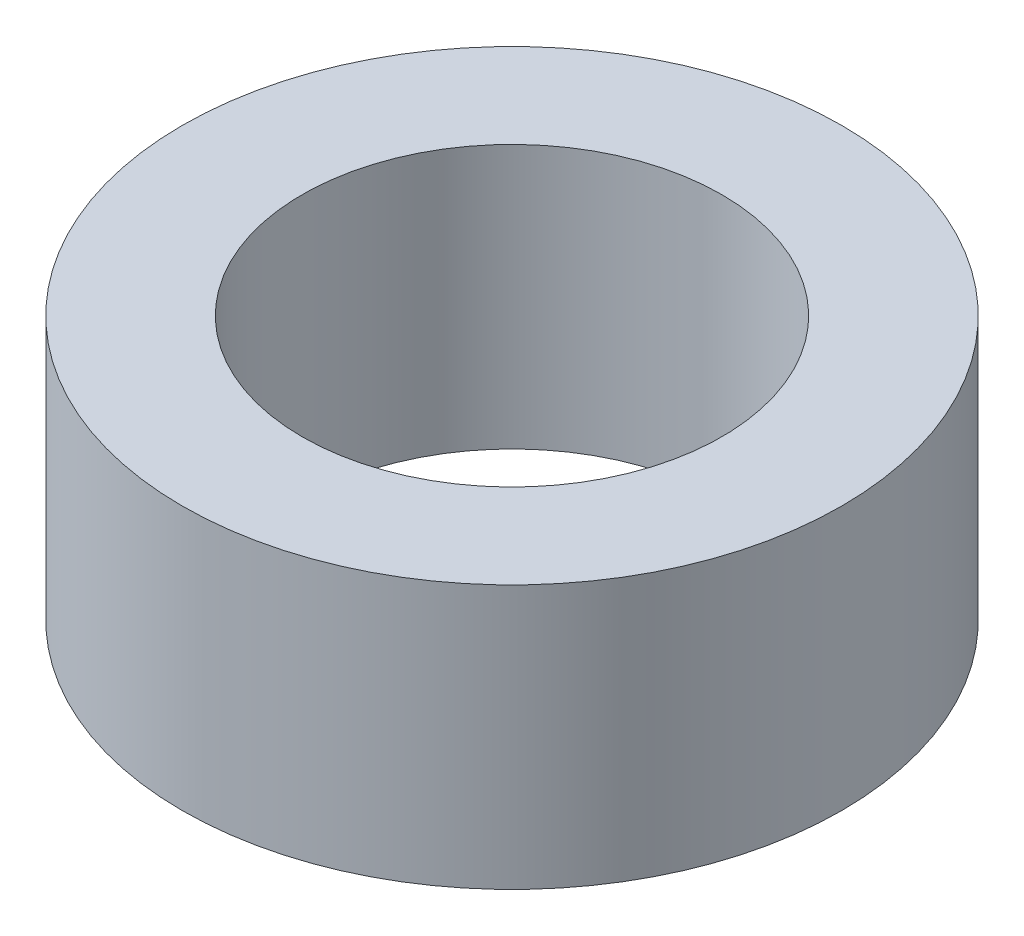
ISO-10303-21;
HEADER;
FILE_DESCRIPTION(('STEP AP214'),'2;1');
FILE_NAME('part.step','',(''),(''),'','','');
FILE_SCHEMA(('AUTOMOTIVE_DESIGN { 1 0 10303 214 1 1 1 1 }'));
ENDSEC;
DATA;
#1=APPLICATION_CONTEXT('core data for automotive mechanical design processes');
#2=APPLICATION_PROTOCOL_DEFINITION('international standard','automotive_design',2000,#1);
#3=PRODUCT_CONTEXT('',#1,'mechanical');
#4=PRODUCT('Part','Part','',(#3));
#5=PRODUCT_RELATED_PRODUCT_CATEGORY('part','',(#4));
#6=PRODUCT_DEFINITION_FORMATION('','',#4);
#7=PRODUCT_DEFINITION_CONTEXT('part definition',#1,'design');
#8=PRODUCT_DEFINITION('design','',#6,#7);
#9=PRODUCT_DEFINITION_SHAPE('','',#8);
#10=(LENGTH_UNIT() NAMED_UNIT(*) SI_UNIT(.MILLI.,.METRE.));
#11=(NAMED_UNIT(*) PLANE_ANGLE_UNIT() SI_UNIT($,.RADIAN.));
#12=(NAMED_UNIT(*) SI_UNIT($,.STERADIAN.) SOLID_ANGLE_UNIT());
#13=UNCERTAINTY_MEASURE_WITH_UNIT(LENGTH_MEASURE(1.E-05),#10,'distance_accuracy_value','');
#14=(GEOMETRIC_REPRESENTATION_CONTEXT(3) GLOBAL_UNCERTAINTY_ASSIGNED_CONTEXT((#13)) GLOBAL_UNIT_ASSIGNED_CONTEXT((#10,
#11,#12)) REPRESENTATION_CONTEXT('',''));
#15=CARTESIAN_POINT('',(0.,0.,0.));
#16=DIRECTION('',(0.,0.,1.));
#17=DIRECTION('',(1.,0.,0.));
#18=AXIS2_PLACEMENT_3D('',#15,#16,#17);
#19=CARTESIAN_POINT('',(0.,22.,0.));
#20=DIRECTION('',(0.,-1.,0.));
#21=DIRECTION('',(0.,0.,-1.));
#22=AXIS2_PLACEMENT_3D('',#19,#20,#21);
#23=CYLINDRICAL_SURFACE('',#22,27.5);
#24=CARTESIAN_POINT('',(0.,22.,0.));
#25=DIRECTION('',(0.,1.,0.));
#26=DIRECTION('',(0.,0.,1.));
#27=AXIS2_PLACEMENT_3D('',#24,#25,#26);
#28=CIRCLE('',#27,27.5);
#29=CARTESIAN_POINT('',(0.,22.,27.5));
#30=VERTEX_POINT('',#29);
#31=EDGE_CURVE('E10',#30,#30,#28,.T.);
#32=ORIENTED_EDGE('',*,*,#31,.F.);
#33=EDGE_LOOP('',(#32));
#34=FACE_BOUND('',#33,.T.);
#35=CARTESIAN_POINT('',(0.,0.,0.));
#36=DIRECTION('',(0.,1.,0.));
#37=DIRECTION('',(0.,0.,1.));
#38=AXIS2_PLACEMENT_3D('',#35,#36,#37);
#39=CIRCLE('',#38,27.5);
#40=CARTESIAN_POINT('',(0.,0.,27.5));
#41=VERTEX_POINT('',#40);
#42=EDGE_CURVE('E37',#41,#41,#39,.T.);
#43=ORIENTED_EDGE('',*,*,#42,.T.);
#44=EDGE_LOOP('',(#43));
#45=FACE_BOUND('',#44,.T.);
#46=ADVANCED_FACE('F40',(#34,#45),#23,.T.);
#47=CARTESIAN_POINT('',(0.,22.,0.));
#48=DIRECTION('',(0.,1.,0.));
#49=DIRECTION('',(0.,0.,1.));
#50=AXIS2_PLACEMENT_3D('',#47,#48,#49);
#51=PLANE('',#50);
#52=CARTESIAN_POINT('',(0.,22.,0.));
#53=DIRECTION('',(0.,1.,0.));
#54=DIRECTION('',(0.,0.,1.));
#55=AXIS2_PLACEMENT_3D('',#52,#53,#54);
#56=CIRCLE('',#55,17.5);
#57=CARTESIAN_POINT('',(0.,22.,17.5));
#58=VERTEX_POINT('',#57);
#59=EDGE_CURVE('E50',#58,#58,#56,.T.);
#60=ORIENTED_EDGE('',*,*,#59,.F.);
#61=EDGE_LOOP('',(#60));
#62=FACE_BOUND('',#61,.T.);
#63=ORIENTED_EDGE('',*,*,#31,.T.);
#64=EDGE_LOOP('',(#63));
#65=FACE_BOUND('',#64,.T.);
#66=ADVANCED_FACE('F59',(#62,#65),#51,.T.);
#67=CARTESIAN_POINT('',(0.,0.,0.));
#68=DIRECTION('',(0.,1.,0.));
#69=DIRECTION('',(0.,0.,1.));
#70=AXIS2_PLACEMENT_3D('',#67,#68,#69);
#71=PLANE('',#70);
#72=CARTESIAN_POINT('',(0.,0.,0.));
#73=DIRECTION('',(0.,1.,0.));
#74=DIRECTION('',(0.,0.,1.));
#75=AXIS2_PLACEMENT_3D('',#72,#73,#74);
#76=CIRCLE('',#75,17.5);
#77=CARTESIAN_POINT('',(0.,0.,17.5));
#78=VERTEX_POINT('',#77);
#79=EDGE_CURVE('E47',#78,#78,#76,.T.);
#80=ORIENTED_EDGE('',*,*,#79,.T.);
#81=EDGE_LOOP('',(#80));
#82=FACE_BOUND('',#81,.T.);
#83=ORIENTED_EDGE('',*,*,#42,.F.);
#84=EDGE_LOOP('',(#83));
#85=FACE_BOUND('',#84,.T.);
#86=ADVANCED_FACE('F58',(#82,#85),#71,.F.);
#87=CARTESIAN_POINT('',(0.,22.,0.));
#88=DIRECTION('',(0.,-1.,0.));
#89=DIRECTION('',(0.,0.,-1.));
#90=AXIS2_PLACEMENT_3D('',#87,#88,#89);
#91=CYLINDRICAL_SURFACE('',#90,17.5);
#92=ORIENTED_EDGE('',*,*,#59,.T.);
#93=EDGE_LOOP('',(#92));
#94=FACE_BOUND('',#93,.T.);
#95=ORIENTED_EDGE('',*,*,#79,.F.);
#96=EDGE_LOOP('',(#95));
#97=FACE_BOUND('',#96,.T.);
#98=ADVANCED_FACE('F54',(#94,#97),#91,.F.);
#99=CLOSED_SHELL('',(#46,#66,#86,#98));
#100=MANIFOLD_SOLID_BREP('B2',#99);
#101=ADVANCED_BREP_SHAPE_REPRESENTATION('',(#18,#100),#14);
#102=SHAPE_DEFINITION_REPRESENTATION(#9,#101);
ENDSEC;
END-ISO-10303-21;
